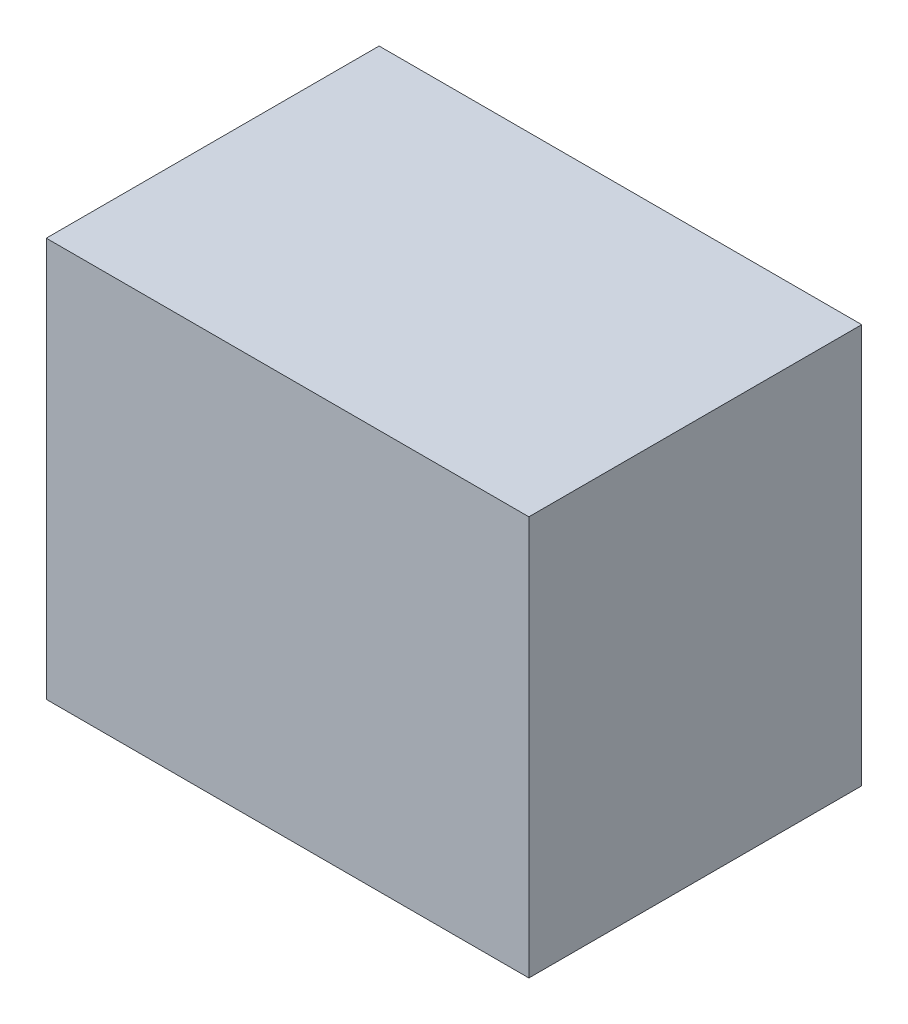
ISO-10303-21;
HEADER;
FILE_DESCRIPTION(('STEP AP214'),'2;1');
FILE_NAME('part.step','',(''),(''),'','','');
FILE_SCHEMA(('AUTOMOTIVE_DESIGN { 1 0 10303 214 1 1 1 1 }'));
ENDSEC;
DATA;
#1=APPLICATION_CONTEXT('core data for automotive mechanical design processes');
#2=APPLICATION_PROTOCOL_DEFINITION('international standard','automotive_design',2000,#1);
#3=PRODUCT_CONTEXT('',#1,'mechanical');
#4=PRODUCT('Part','Part','',(#3));
#5=PRODUCT_RELATED_PRODUCT_CATEGORY('part','',(#4));
#6=PRODUCT_DEFINITION_FORMATION('','',#4);
#7=PRODUCT_DEFINITION_CONTEXT('part definition',#1,'design');
#8=PRODUCT_DEFINITION('design','',#6,#7);
#9=PRODUCT_DEFINITION_SHAPE('','',#8);
#10=(LENGTH_UNIT() NAMED_UNIT(*) SI_UNIT(.MILLI.,.METRE.));
#11=(NAMED_UNIT(*) PLANE_ANGLE_UNIT() SI_UNIT($,.RADIAN.));
#12=(NAMED_UNIT(*) SI_UNIT($,.STERADIAN.) SOLID_ANGLE_UNIT());
#13=UNCERTAINTY_MEASURE_WITH_UNIT(LENGTH_MEASURE(1.E-05),#10,'distance_accuracy_value','');
#14=(GEOMETRIC_REPRESENTATION_CONTEXT(3) GLOBAL_UNCERTAINTY_ASSIGNED_CONTEXT((#13)) GLOBAL_UNIT_ASSIGNED_CONTEXT((#10,
#11,#12)) REPRESENTATION_CONTEXT('',''));
#15=CARTESIAN_POINT('',(0.,0.,0.));
#16=DIRECTION('',(0.,0.,1.));
#17=DIRECTION('',(1.,0.,0.));
#18=AXIS2_PLACEMENT_3D('',#15,#16,#17);
#19=CARTESIAN_POINT('',(0.72499982,0.60000134,0.));
#20=DIRECTION('',(0.,-1.,0.));
#21=DIRECTION('',(-1.,0.,0.));
#22=AXIS2_PLACEMENT_3D('',#19,#20,#21);
#23=PLANE('',#22);
#24=DIRECTION('',(-1.,0.,0.));
#25=VECTOR('',#24,1.);
#26=CARTESIAN_POINT('',(0.72499982,0.60000134,0.));
#27=LINE('',#26,#25);
#28=CARTESIAN_POINT('',(0.72499982,0.60000134,0.));
#29=VERTEX_POINT('',#28);
#30=CARTESIAN_POINT('',(-0.72499982,0.60000134,0.));
#31=VERTEX_POINT('',#30);
#32=EDGE_CURVE('E11',#29,#31,#27,.T.);
#33=ORIENTED_EDGE('',*,*,#32,.T.);
#34=DIRECTION('',(0.,0.,1.));
#35=VECTOR('',#34,1.);
#36=CARTESIAN_POINT('',(-0.72499982,0.60000134,0.));
#37=LINE('',#36,#35);
#38=CARTESIAN_POINT('',(-0.72499982,0.60000134,1.00000054));
#39=VERTEX_POINT('',#38);
#40=EDGE_CURVE('E24',#31,#39,#37,.T.);
#41=ORIENTED_EDGE('',*,*,#40,.T.);
#42=DIRECTION('',(-1.,0.,0.));
#43=VECTOR('',#42,1.);
#44=CARTESIAN_POINT('',(0.72499982,0.60000134,1.00000054));
#45=LINE('',#44,#43);
#46=CARTESIAN_POINT('',(0.72499982,0.60000134,1.00000054));
#47=VERTEX_POINT('',#46);
#48=EDGE_CURVE('E87',#47,#39,#45,.T.);
#49=ORIENTED_EDGE('',*,*,#48,.F.);
#50=DIRECTION('',(0.,0.,1.));
#51=VECTOR('',#50,1.);
#52=CARTESIAN_POINT('',(0.72499982,0.60000134,0.));
#53=LINE('',#52,#51);
#54=EDGE_CURVE('E36',#29,#47,#53,.T.);
#55=ORIENTED_EDGE('',*,*,#54,.F.);
#56=EDGE_LOOP('',(#33,#41,#49,#55));
#57=FACE_BOUND('',#56,.T.);
#58=ADVANCED_FACE('F17',(#57),#23,.F.);
#59=CARTESIAN_POINT('',(-0.72499982,0.60000134,0.));
#60=DIRECTION('',(1.,0.,0.));
#61=DIRECTION('',(0.,-1.,0.));
#62=AXIS2_PLACEMENT_3D('',#59,#60,#61);
#63=PLANE('',#62);
#64=DIRECTION('',(0.,-1.,0.));
#65=VECTOR('',#64,1.);
#66=CARTESIAN_POINT('',(-0.72499982,0.60000134,0.));
#67=LINE('',#66,#65);
#68=CARTESIAN_POINT('',(-0.72499982,-0.5999988,0.));
#69=VERTEX_POINT('',#68);
#70=EDGE_CURVE('E84',#31,#69,#67,.T.);
#71=ORIENTED_EDGE('',*,*,#70,.T.);
#72=DIRECTION('',(0.,0.,1.));
#73=VECTOR('',#72,1.);
#74=CARTESIAN_POINT('',(-0.72499982,-0.5999988,0.));
#75=LINE('',#74,#73);
#76=CARTESIAN_POINT('',(-0.72499982,-0.5999988,1.00000054));
#77=VERTEX_POINT('',#76);
#78=EDGE_CURVE('E82',#69,#77,#75,.T.);
#79=ORIENTED_EDGE('',*,*,#78,.T.);
#80=DIRECTION('',(0.,-1.,0.));
#81=VECTOR('',#80,1.);
#82=CARTESIAN_POINT('',(-0.72499982,0.60000134,1.00000054));
#83=LINE('',#82,#81);
#84=EDGE_CURVE('E62',#39,#77,#83,.T.);
#85=ORIENTED_EDGE('',*,*,#84,.F.);
#86=ORIENTED_EDGE('',*,*,#40,.F.);
#87=EDGE_LOOP('',(#71,#79,#85,#86));
#88=FACE_BOUND('',#87,.T.);
#89=ADVANCED_FACE('F89',(#88),#63,.F.);
#90=CARTESIAN_POINT('',(-0.72499982,-0.5999988,0.));
#91=DIRECTION('',(0.,1.,0.));
#92=DIRECTION('',(1.,0.,0.));
#93=AXIS2_PLACEMENT_3D('',#90,#91,#92);
#94=PLANE('',#93);
#95=DIRECTION('',(1.,0.,0.));
#96=VECTOR('',#95,1.);
#97=CARTESIAN_POINT('',(-0.72499982,-0.5999988,0.));
#98=LINE('',#97,#96);
#99=CARTESIAN_POINT('',(0.72499982,-0.5999988,0.));
#100=VERTEX_POINT('',#99);
#101=EDGE_CURVE('E71',#69,#100,#98,.T.);
#102=ORIENTED_EDGE('',*,*,#101,.T.);
#103=DIRECTION('',(0.,0.,1.));
#104=VECTOR('',#103,1.);
#105=CARTESIAN_POINT('',(0.72499982,-0.5999988,0.));
#106=LINE('',#105,#104);
#107=CARTESIAN_POINT('',(0.72499982,-0.5999988,1.00000054));
#108=VERTEX_POINT('',#107);
#109=EDGE_CURVE('E65',#100,#108,#106,.T.);
#110=ORIENTED_EDGE('',*,*,#109,.T.);
#111=DIRECTION('',(1.,0.,0.));
#112=VECTOR('',#111,1.);
#113=CARTESIAN_POINT('',(-0.72499982,-0.5999988,1.00000054));
#114=LINE('',#113,#112);
#115=EDGE_CURVE('E57',#77,#108,#114,.T.);
#116=ORIENTED_EDGE('',*,*,#115,.F.);
#117=ORIENTED_EDGE('',*,*,#78,.F.);
#118=EDGE_LOOP('',(#102,#110,#116,#117));
#119=FACE_BOUND('',#118,.T.);
#120=ADVANCED_FACE('F69',(#119),#94,.F.);
#121=CARTESIAN_POINT('',(0.72499982,-0.5999988,0.));
#122=DIRECTION('',(-1.,0.,0.));
#123=DIRECTION('',(0.,1.,0.));
#124=AXIS2_PLACEMENT_3D('',#121,#122,#123);
#125=PLANE('',#124);
#126=DIRECTION('',(0.,1.,0.));
#127=VECTOR('',#126,1.);
#128=CARTESIAN_POINT('',(0.72499982,-0.5999988,0.));
#129=LINE('',#128,#127);
#130=EDGE_CURVE('E66',#100,#29,#129,.T.);
#131=ORIENTED_EDGE('',*,*,#130,.T.);
#132=ORIENTED_EDGE('',*,*,#54,.T.);
#133=DIRECTION('',(0.,1.,0.));
#134=VECTOR('',#133,1.);
#135=CARTESIAN_POINT('',(0.72499982,-0.5999988,1.00000054));
#136=LINE('',#135,#134);
#137=EDGE_CURVE('E61',#108,#47,#136,.T.);
#138=ORIENTED_EDGE('',*,*,#137,.F.);
#139=ORIENTED_EDGE('',*,*,#109,.F.);
#140=EDGE_LOOP('',(#131,#132,#138,#139));
#141=FACE_BOUND('',#140,.T.);
#142=ADVANCED_FACE('F76',(#141),#125,.F.);
#143=CARTESIAN_POINT('',(0.72499982,0.60000134,0.));
#144=DIRECTION('',(0.,0.,-1.));
#145=DIRECTION('',(-1.,0.,0.));
#146=AXIS2_PLACEMENT_3D('',#143,#144,#145);
#147=PLANE('',#146);
#148=ORIENTED_EDGE('',*,*,#130,.F.);
#149=ORIENTED_EDGE('',*,*,#101,.F.);
#150=ORIENTED_EDGE('',*,*,#70,.F.);
#151=ORIENTED_EDGE('',*,*,#32,.F.);
#152=EDGE_LOOP('',(#148,#149,#150,#151));
#153=FACE_BOUND('',#152,.T.);
#154=ADVANCED_FACE('F91',(#153),#147,.T.);
#155=CARTESIAN_POINT('',(0.72499982,0.60000134,1.00000054));
#156=DIRECTION('',(0.,0.,-1.));
#157=DIRECTION('',(-1.,0.,0.));
#158=AXIS2_PLACEMENT_3D('',#155,#156,#157);
#159=PLANE('',#158);
#160=ORIENTED_EDGE('',*,*,#48,.T.);
#161=ORIENTED_EDGE('',*,*,#84,.T.);
#162=ORIENTED_EDGE('',*,*,#115,.T.);
#163=ORIENTED_EDGE('',*,*,#137,.T.);
#164=EDGE_LOOP('',(#160,#161,#162,#163));
#165=FACE_BOUND('',#164,.T.);
#166=ADVANCED_FACE('F59',(#165),#159,.F.);
#167=CLOSED_SHELL('',(#58,#89,#120,#142,#154,#166));
#168=MANIFOLD_SOLID_BREP('B1',#167);
#169=ADVANCED_BREP_SHAPE_REPRESENTATION('',(#18,#168),#14);
#170=SHAPE_DEFINITION_REPRESENTATION(#9,#169);
ENDSEC;
END-ISO-10303-21;
